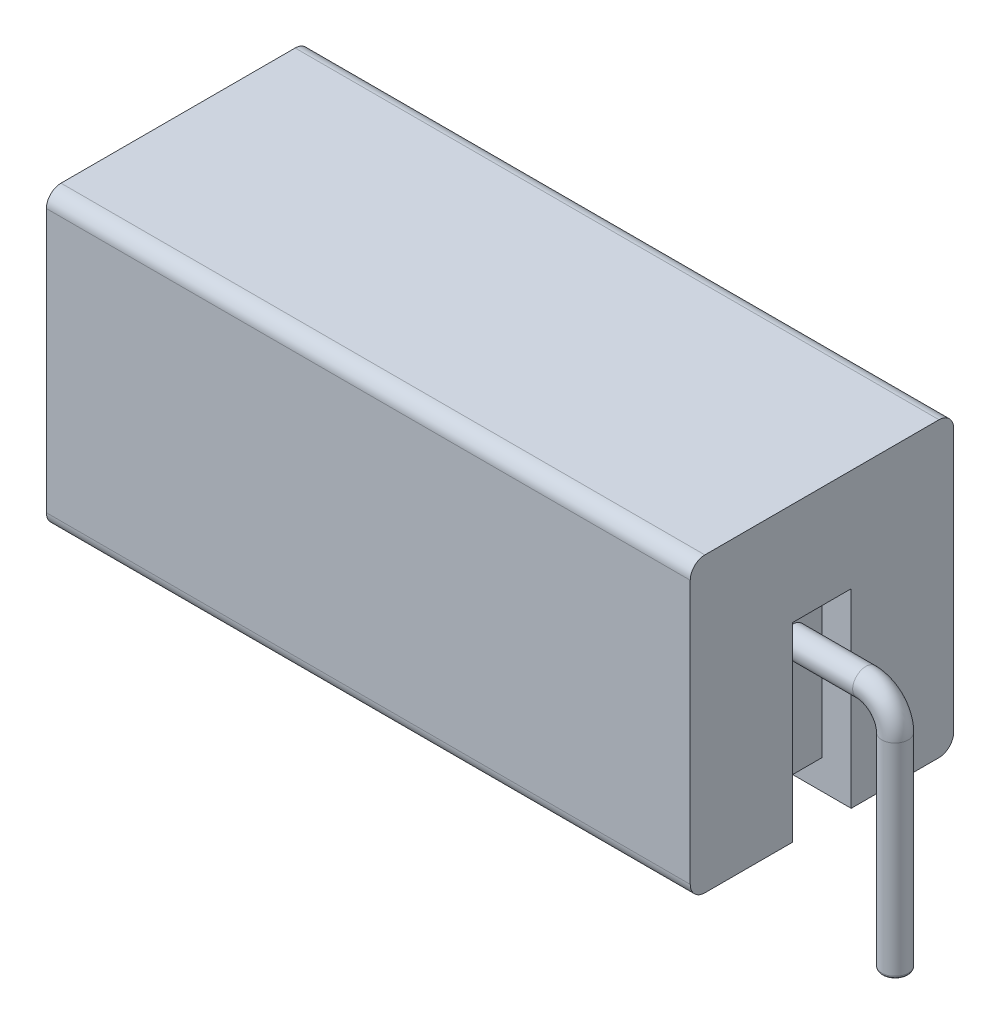
ISO-10303-21;
HEADER;
FILE_DESCRIPTION(('STEP AP214'),'2;1');
FILE_NAME('part.step','',(''),(''),'','','');
FILE_SCHEMA(('AUTOMOTIVE_DESIGN { 1 0 10303 214 1 1 1 1 }'));
ENDSEC;
DATA;
#1=APPLICATION_CONTEXT('core data for automotive mechanical design processes');
#2=APPLICATION_PROTOCOL_DEFINITION('international standard','automotive_design',2000,#1);
#3=PRODUCT_CONTEXT('',#1,'mechanical');
#4=PRODUCT('Part','Part','',(#3));
#5=PRODUCT_RELATED_PRODUCT_CATEGORY('part','',(#4));
#6=PRODUCT_DEFINITION_FORMATION('','',#4);
#7=PRODUCT_DEFINITION_CONTEXT('part definition',#1,'design');
#8=PRODUCT_DEFINITION('design','',#6,#7);
#9=PRODUCT_DEFINITION_SHAPE('','',#8);
#10=(LENGTH_UNIT() NAMED_UNIT(*) SI_UNIT(.MILLI.,.METRE.));
#11=(NAMED_UNIT(*) PLANE_ANGLE_UNIT() SI_UNIT($,.RADIAN.));
#12=(NAMED_UNIT(*) SI_UNIT($,.STERADIAN.) SOLID_ANGLE_UNIT());
#13=UNCERTAINTY_MEASURE_WITH_UNIT(LENGTH_MEASURE(1.E-05),#10,'distance_accuracy_value','');
#14=(GEOMETRIC_REPRESENTATION_CONTEXT(3) GLOBAL_UNCERTAINTY_ASSIGNED_CONTEXT((#13)) GLOBAL_UNIT_ASSIGNED_CONTEXT((#10,
#11,#12)) REPRESENTATION_CONTEXT('',''));
#15=CARTESIAN_POINT('',(0.,0.,0.));
#16=DIRECTION('',(0.,0.,1.));
#17=DIRECTION('',(1.,0.,0.));
#18=AXIS2_PLACEMENT_3D('',#15,#16,#17);
#19=CARTESIAN_POINT('',(0.,-10.,9.));
#20=DIRECTION('',(0.,1.,0.));
#21=DIRECTION('',(0.,0.,1.));
#22=AXIS2_PLACEMENT_3D('',#19,#20,#21);
#23=PLANE('',#22);
#24=DIRECTION('',(-1.,0.,0.));
#25=VECTOR('',#24,1.);
#26=CARTESIAN_POINT('',(1.,-10.,5.5));
#27=LINE('',#26,#25);
#28=CARTESIAN_POINT('',(3.,-10.,5.5));
#29=VERTEX_POINT('',#28);
#30=CARTESIAN_POINT('',(0.,-10.,5.5));
#31=VERTEX_POINT('',#30);
#32=EDGE_CURVE('E252',#29,#31,#27,.T.);
#33=ORIENTED_EDGE('',*,*,#32,.F.);
#34=DIRECTION('',(0.,0.,-1.));
#35=VECTOR('',#34,1.);
#36=CARTESIAN_POINT('',(3.,-10.,8.));
#37=LINE('',#36,#35);
#38=CARTESIAN_POINT('',(3.,-10.,8.));
#39=VERTEX_POINT('',#38);
#40=EDGE_CURVE('E380',#39,#29,#37,.T.);
#41=ORIENTED_EDGE('',*,*,#40,.F.);
#42=DIRECTION('',(-1.,0.,0.));
#43=VECTOR('',#42,1.);
#44=CARTESIAN_POINT('',(3.,-10.,8.));
#45=LINE('',#44,#43);
#46=CARTESIAN_POINT('',(19.,-10.,8.));
#47=VERTEX_POINT('',#46);
#48=EDGE_CURVE('E372',#47,#39,#45,.T.);
#49=ORIENTED_EDGE('',*,*,#48,.F.);
#50=DIRECTION('',(0.,0.,1.));
#51=VECTOR('',#50,1.);
#52=CARTESIAN_POINT('',(19.,-10.,8.));
#53=LINE('',#52,#51);
#54=CARTESIAN_POINT('',(19.,-10.,5.5));
#55=VERTEX_POINT('',#54);
#56=EDGE_CURVE('E368',#55,#47,#53,.T.);
#57=ORIENTED_EDGE('',*,*,#56,.F.);
#58=DIRECTION('',(-1.,0.,0.));
#59=VECTOR('',#58,1.);
#60=CARTESIAN_POINT('',(22.,-10.,5.5));
#61=LINE('',#60,#59);
#62=CARTESIAN_POINT('',(22.,-10.,5.5));
#63=VERTEX_POINT('',#62);
#64=EDGE_CURVE('E276',#63,#55,#61,.T.);
#65=ORIENTED_EDGE('',*,*,#64,.F.);
#66=DIRECTION('',(0.,0.,-1.));
#67=VECTOR('',#66,1.);
#68=CARTESIAN_POINT('',(22.,-10.,9.));
#69=LINE('',#68,#67);
#70=CARTESIAN_POINT('',(22.,-10.,8.5));
#71=VERTEX_POINT('',#70);
#72=EDGE_CURVE('E413',#71,#63,#69,.T.);
#73=ORIENTED_EDGE('',*,*,#72,.F.);
#74=DIRECTION('',(1.,0.,0.));
#75=VECTOR('',#74,1.);
#76=CARTESIAN_POINT('',(0.,-10.,8.5));
#77=LINE('',#76,#75);
#78=CARTESIAN_POINT('',(0.,-10.,8.5));
#79=VERTEX_POINT('',#78);
#80=EDGE_CURVE('E445',#71,#79,#77,.F.);
#81=ORIENTED_EDGE('',*,*,#80,.T.);
#82=DIRECTION('',(0.,0.,-1.));
#83=VECTOR('',#82,1.);
#84=CARTESIAN_POINT('',(0.,-10.,9.));
#85=LINE('',#84,#83);
#86=EDGE_CURVE('E412',#79,#31,#85,.T.);
#87=ORIENTED_EDGE('',*,*,#86,.T.);
#88=EDGE_LOOP('',(#33,#41,#49,#57,#65,#73,#81,#87));
#89=FACE_BOUND('',#88,.T.);
#90=ADVANCED_FACE('F70',(#89),#23,.F.);
#91=CARTESIAN_POINT('',(0.,0.,9.));
#92=DIRECTION('',(1.,0.,0.));
#93=DIRECTION('',(0.,1.,0.));
#94=AXIS2_PLACEMENT_3D('',#91,#92,#93);
#95=PLANE('',#94);
#96=CARTESIAN_POINT('',(0.,-10.,3.5));
#97=VERTEX_POINT('',#96);
#98=CARTESIAN_POINT('',(0.,-10.,0.5));
#99=VERTEX_POINT('',#98);
#100=EDGE_CURVE('E405',#97,#99,#85,.T.);
#101=ORIENTED_EDGE('',*,*,#100,.F.);
#102=DIRECTION('',(0.,-1.,0.));
#103=VECTOR('',#102,1.);
#104=CARTESIAN_POINT('',(0.,-3.5,3.5));
#105=LINE('',#104,#103);
#106=CARTESIAN_POINT('',(0.,-3.5,3.5));
#107=VERTEX_POINT('',#106);
#108=EDGE_CURVE('E267',#107,#97,#105,.T.);
#109=ORIENTED_EDGE('',*,*,#108,.F.);
#110=DIRECTION('',(0.,0.,-1.));
#111=VECTOR('',#110,1.);
#112=CARTESIAN_POINT('',(0.,-3.5,5.5));
#113=LINE('',#112,#111);
#114=CARTESIAN_POINT('',(0.,-3.5,5.5));
#115=VERTEX_POINT('',#114);
#116=EDGE_CURVE('E263',#115,#107,#113,.T.);
#117=ORIENTED_EDGE('',*,*,#116,.F.);
#118=DIRECTION('',(0.,1.,0.));
#119=VECTOR('',#118,1.);
#120=CARTESIAN_POINT('',(0.,-10.,5.5));
#121=LINE('',#120,#119);
#122=EDGE_CURVE('E260',#31,#115,#121,.T.);
#123=ORIENTED_EDGE('',*,*,#122,.F.);
#124=ORIENTED_EDGE('',*,*,#86,.F.);
#125=CARTESIAN_POINT('',(0.,-9.5,8.5));
#126=DIRECTION('',(1.,0.,0.));
#127=DIRECTION('',(0.,1.,0.));
#128=AXIS2_PLACEMENT_3D('',#125,#126,#127);
#129=CIRCLE('',#128,0.5);
#130=CARTESIAN_POINT('',(0.,-9.5,9.));
#131=VERTEX_POINT('',#130);
#132=EDGE_CURVE('E440',#79,#131,#129,.F.);
#133=ORIENTED_EDGE('',*,*,#132,.T.);
#134=DIRECTION('',(0.,-1.,0.));
#135=VECTOR('',#134,1.);
#136=CARTESIAN_POINT('',(0.,0.,9.));
#137=LINE('',#136,#135);
#138=CARTESIAN_POINT('',(0.,-0.5,9.));
#139=VERTEX_POINT('',#138);
#140=EDGE_CURVE('E461',#139,#131,#137,.T.);
#141=ORIENTED_EDGE('',*,*,#140,.F.);
#142=CARTESIAN_POINT('',(0.,-0.5,8.5));
#143=DIRECTION('',(1.,0.,0.));
#144=DIRECTION('',(0.,1.,0.));
#145=AXIS2_PLACEMENT_3D('',#142,#143,#144);
#146=CIRCLE('',#145,0.5);
#147=CARTESIAN_POINT('',(0.,0.,8.5));
#148=VERTEX_POINT('',#147);
#149=EDGE_CURVE('E438',#139,#148,#146,.F.);
#150=ORIENTED_EDGE('',*,*,#149,.T.);
#151=DIRECTION('',(0.,0.,-1.));
#152=VECTOR('',#151,1.);
#153=CARTESIAN_POINT('',(0.,0.,9.));
#154=LINE('',#153,#152);
#155=CARTESIAN_POINT('',(0.,0.,0.5));
#156=VERTEX_POINT('',#155);
#157=EDGE_CURVE('E466',#148,#156,#154,.T.);
#158=ORIENTED_EDGE('',*,*,#157,.T.);
#159=CARTESIAN_POINT('',(0.,-0.5,0.5));
#160=DIRECTION('',(1.,0.,0.));
#161=DIRECTION('',(0.,1.,0.));
#162=AXIS2_PLACEMENT_3D('',#159,#160,#161);
#163=CIRCLE('',#162,0.5);
#164=CARTESIAN_POINT('',(0.,-0.5,0.));
#165=VERTEX_POINT('',#164);
#166=EDGE_CURVE('E443',#156,#165,#163,.F.);
#167=ORIENTED_EDGE('',*,*,#166,.T.);
#168=DIRECTION('',(0.,-1.,0.));
#169=VECTOR('',#168,1.);
#170=CARTESIAN_POINT('',(0.,0.,0.));
#171=LINE('',#170,#169);
#172=CARTESIAN_POINT('',(0.,-9.5,0.));
#173=VERTEX_POINT('',#172);
#174=EDGE_CURVE('E287',#165,#173,#171,.T.);
#175=ORIENTED_EDGE('',*,*,#174,.T.);
#176=CARTESIAN_POINT('',(0.,-9.5,0.5));
#177=DIRECTION('',(1.,0.,0.));
#178=DIRECTION('',(0.,1.,0.));
#179=AXIS2_PLACEMENT_3D('',#176,#177,#178);
#180=CIRCLE('',#179,0.5);
#181=EDGE_CURVE('E410',#173,#99,#180,.F.);
#182=ORIENTED_EDGE('',*,*,#181,.T.);
#183=EDGE_LOOP('',(#101,#109,#117,#123,#124,#133,#141,#150,#158,#167,#175,#182));
#184=FACE_BOUND('',#183,.T.);
#185=ADVANCED_FACE('F331',(#184),#95,.F.);
#186=DIRECTION('',(-1.,0.,0.));
#187=VECTOR('',#186,1.);
#188=CARTESIAN_POINT('',(22.,-10.,3.5));
#189=LINE('',#188,#187);
#190=CARTESIAN_POINT('',(22.,-10.,3.5));
#191=VERTEX_POINT('',#190);
#192=CARTESIAN_POINT('',(19.,-10.,3.5));
#193=VERTEX_POINT('',#192);
#194=EDGE_CURVE('E93',#191,#193,#189,.T.);
#195=ORIENTED_EDGE('',*,*,#194,.T.);
#196=DIRECTION('',(0.,0.,1.));
#197=VECTOR('',#196,1.);
#198=CARTESIAN_POINT('',(19.,-10.,0.999999999999997));
#199=LINE('',#198,#197);
#200=CARTESIAN_POINT('',(19.,-10.,0.999999999999997));
#201=VERTEX_POINT('',#200);
#202=EDGE_CURVE('E353',#201,#193,#199,.T.);
#203=ORIENTED_EDGE('',*,*,#202,.F.);
#204=DIRECTION('',(1.,0.,0.));
#205=VECTOR('',#204,1.);
#206=CARTESIAN_POINT('',(19.,-10.,0.999999999999997));
#207=LINE('',#206,#205);
#208=CARTESIAN_POINT('',(3.,-10.,0.999999999999995));
#209=VERTEX_POINT('',#208);
#210=EDGE_CURVE('E369',#209,#201,#207,.T.);
#211=ORIENTED_EDGE('',*,*,#210,.F.);
#212=DIRECTION('',(0.,0.,-1.));
#213=VECTOR('',#212,1.);
#214=CARTESIAN_POINT('',(3.,-10.,0.999999999999995));
#215=LINE('',#214,#213);
#216=CARTESIAN_POINT('',(3.,-10.,3.5));
#217=VERTEX_POINT('',#216);
#218=EDGE_CURVE('E374',#217,#209,#215,.T.);
#219=ORIENTED_EDGE('',*,*,#218,.F.);
#220=DIRECTION('',(-1.,0.,0.));
#221=VECTOR('',#220,1.);
#222=CARTESIAN_POINT('',(1.,-10.,3.5));
#223=LINE('',#222,#221);
#224=EDGE_CURVE('E269',#217,#97,#223,.T.);
#225=ORIENTED_EDGE('',*,*,#224,.T.);
#226=ORIENTED_EDGE('',*,*,#100,.T.);
#227=DIRECTION('',(1.,0.,0.));
#228=VECTOR('',#227,1.);
#229=CARTESIAN_POINT('',(0.,-10.,0.5));
#230=LINE('',#229,#228);
#231=CARTESIAN_POINT('',(22.,-10.,0.5));
#232=VERTEX_POINT('',#231);
#233=EDGE_CURVE('E447',#99,#232,#230,.T.);
#234=ORIENTED_EDGE('',*,*,#233,.T.);
#235=EDGE_CURVE('E301',#191,#232,#69,.T.);
#236=ORIENTED_EDGE('',*,*,#235,.F.);
#237=EDGE_LOOP('',(#195,#203,#211,#219,#225,#226,#234,#236));
#238=FACE_BOUND('',#237,.T.);
#239=ADVANCED_FACE('F334',(#238),#23,.F.);
#240=CARTESIAN_POINT('',(22.,0.,9.));
#241=DIRECTION('',(1.,0.,0.));
#242=DIRECTION('',(0.,0.,-1.));
#243=AXIS2_PLACEMENT_3D('',#240,#241,#242);
#244=PLANE('',#243);
#245=DIRECTION('',(0.,1.,0.));
#246=VECTOR('',#245,1.);
#247=CARTESIAN_POINT('',(22.,-10.,5.5));
#248=LINE('',#247,#246);
#249=CARTESIAN_POINT('',(22.,-3.5,5.5));
#250=VERTEX_POINT('',#249);
#251=EDGE_CURVE('E278',#63,#250,#248,.T.);
#252=ORIENTED_EDGE('',*,*,#251,.T.);
#253=DIRECTION('',(0.,0.,-1.));
#254=VECTOR('',#253,1.);
#255=CARTESIAN_POINT('',(22.,-3.5,5.5));
#256=LINE('',#255,#254);
#257=CARTESIAN_POINT('',(22.,-3.5,3.5));
#258=VERTEX_POINT('',#257);
#259=EDGE_CURVE('E503',#250,#258,#256,.T.);
#260=ORIENTED_EDGE('',*,*,#259,.T.);
#261=DIRECTION('',(0.,-1.,0.));
#262=VECTOR('',#261,1.);
#263=CARTESIAN_POINT('',(22.,-3.5,3.5));
#264=LINE('',#263,#262);
#265=EDGE_CURVE('E288',#258,#191,#264,.T.);
#266=ORIENTED_EDGE('',*,*,#265,.T.);
#267=ORIENTED_EDGE('',*,*,#235,.T.);
#268=CARTESIAN_POINT('',(22.,-9.5,0.5));
#269=DIRECTION('',(1.,0.,0.));
#270=DIRECTION('',(0.,0.,-1.));
#271=AXIS2_PLACEMENT_3D('',#268,#269,#270);
#272=CIRCLE('',#271,0.5);
#273=CARTESIAN_POINT('',(22.,-9.5,0.));
#274=VERTEX_POINT('',#273);
#275=EDGE_CURVE('E429',#232,#274,#272,.T.);
#276=ORIENTED_EDGE('',*,*,#275,.T.);
#277=DIRECTION('',(0.,-1.,0.));
#278=VECTOR('',#277,1.);
#279=CARTESIAN_POINT('',(22.,0.,0.));
#280=LINE('',#279,#278);
#281=CARTESIAN_POINT('',(22.,-0.5,0.));
#282=VERTEX_POINT('',#281);
#283=EDGE_CURVE('E471',#282,#274,#280,.T.);
#284=ORIENTED_EDGE('',*,*,#283,.F.);
#285=CARTESIAN_POINT('',(22.,-0.5,0.5));
#286=DIRECTION('',(1.,0.,0.));
#287=DIRECTION('',(0.,0.,-1.));
#288=AXIS2_PLACEMENT_3D('',#285,#286,#287);
#289=CIRCLE('',#288,0.5);
#290=CARTESIAN_POINT('',(22.,0.,0.5));
#291=VERTEX_POINT('',#290);
#292=EDGE_CURVE('E431',#282,#291,#289,.T.);
#293=ORIENTED_EDGE('',*,*,#292,.T.);
#294=DIRECTION('',(0.,0.,-1.));
#295=VECTOR('',#294,1.);
#296=CARTESIAN_POINT('',(22.,0.,9.));
#297=LINE('',#296,#295);
#298=CARTESIAN_POINT('',(22.,0.,8.5));
#299=VERTEX_POINT('',#298);
#300=EDGE_CURVE('E469',#299,#291,#297,.T.);
#301=ORIENTED_EDGE('',*,*,#300,.F.);
#302=CARTESIAN_POINT('',(22.,-0.5,8.5));
#303=DIRECTION('',(1.,0.,0.));
#304=DIRECTION('',(0.,0.,-1.));
#305=AXIS2_PLACEMENT_3D('',#302,#303,#304);
#306=CIRCLE('',#305,0.5);
#307=CARTESIAN_POINT('',(22.,-0.5,9.));
#308=VERTEX_POINT('',#307);
#309=EDGE_CURVE('E425',#299,#308,#306,.T.);
#310=ORIENTED_EDGE('',*,*,#309,.T.);
#311=DIRECTION('',(0.,-1.,0.));
#312=VECTOR('',#311,1.);
#313=CARTESIAN_POINT('',(22.,0.,9.));
#314=LINE('',#313,#312);
#315=CARTESIAN_POINT('',(22.,-9.5,9.));
#316=VERTEX_POINT('',#315);
#317=EDGE_CURVE('E458',#308,#316,#314,.T.);
#318=ORIENTED_EDGE('',*,*,#317,.T.);
#319=CARTESIAN_POINT('',(22.,-9.5,8.5));
#320=DIRECTION('',(1.,0.,0.));
#321=DIRECTION('',(0.,0.,-1.));
#322=AXIS2_PLACEMENT_3D('',#319,#320,#321);
#323=CIRCLE('',#322,0.5);
#324=EDGE_CURVE('E427',#316,#71,#323,.T.);
#325=ORIENTED_EDGE('',*,*,#324,.T.);
#326=ORIENTED_EDGE('',*,*,#72,.T.);
#327=EDGE_LOOP('',(#252,#260,#266,#267,#276,#284,#293,#301,#310,#318,#325,#326));
#328=FACE_BOUND('',#327,.T.);
#329=ADVANCED_FACE('F342',(#328),#244,.T.);
#330=CARTESIAN_POINT('',(0.,0.,9.));
#331=DIRECTION('',(0.,1.,0.));
#332=DIRECTION('',(0.,0.,1.));
#333=AXIS2_PLACEMENT_3D('',#330,#331,#332);
#334=PLANE('',#333);
#335=ORIENTED_EDGE('',*,*,#300,.T.);
#336=DIRECTION('',(1.,0.,0.));
#337=VECTOR('',#336,1.);
#338=CARTESIAN_POINT('',(0.,0.,0.5));
#339=LINE('',#338,#337);
#340=EDGE_CURVE('E436',#291,#156,#339,.F.);
#341=ORIENTED_EDGE('',*,*,#340,.T.);
#342=ORIENTED_EDGE('',*,*,#157,.F.);
#343=DIRECTION('',(1.,0.,0.));
#344=VECTOR('',#343,1.);
#345=CARTESIAN_POINT('',(0.,0.,8.5));
#346=LINE('',#345,#344);
#347=EDGE_CURVE('E433',#148,#299,#346,.T.);
#348=ORIENTED_EDGE('',*,*,#347,.T.);
#349=EDGE_LOOP('',(#335,#341,#342,#348));
#350=FACE_BOUND('',#349,.T.);
#351=ADVANCED_FACE('F347',(#350),#334,.T.);
#352=CARTESIAN_POINT('',(0.,0.,9.));
#353=DIRECTION('',(0.,0.,1.));
#354=DIRECTION('',(1.,0.,0.));
#355=AXIS2_PLACEMENT_3D('',#352,#353,#354);
#356=PLANE('',#355);
#357=ORIENTED_EDGE('',*,*,#140,.T.);
#358=DIRECTION('',(1.,0.,0.));
#359=VECTOR('',#358,1.);
#360=CARTESIAN_POINT('',(22.,-9.5,9.));
#361=LINE('',#360,#359);
#362=EDGE_CURVE('E308',#131,#316,#361,.T.);
#363=ORIENTED_EDGE('',*,*,#362,.T.);
#364=ORIENTED_EDGE('',*,*,#317,.F.);
#365=DIRECTION('',(1.,0.,0.));
#366=VECTOR('',#365,1.);
#367=CARTESIAN_POINT('',(0.,-0.5,9.));
#368=LINE('',#367,#366);
#369=EDGE_CURVE('E449',#308,#139,#368,.F.);
#370=ORIENTED_EDGE('',*,*,#369,.T.);
#371=EDGE_LOOP('',(#357,#363,#364,#370));
#372=FACE_BOUND('',#371,.T.);
#373=ADVANCED_FACE('F457',(#372),#356,.T.);
#374=CARTESIAN_POINT('',(0.,0.,0.));
#375=DIRECTION('',(0.,0.,1.));
#376=DIRECTION('',(1.,0.,0.));
#377=AXIS2_PLACEMENT_3D('',#374,#375,#376);
#378=PLANE('',#377);
#379=ORIENTED_EDGE('',*,*,#174,.F.);
#380=DIRECTION('',(1.,0.,0.));
#381=VECTOR('',#380,1.);
#382=CARTESIAN_POINT('',(22.,-0.5,0.));
#383=LINE('',#382,#381);
#384=EDGE_CURVE('E422',#165,#282,#383,.T.);
#385=ORIENTED_EDGE('',*,*,#384,.T.);
#386=ORIENTED_EDGE('',*,*,#283,.T.);
#387=DIRECTION('',(1.,0.,0.));
#388=VECTOR('',#387,1.);
#389=CARTESIAN_POINT('',(0.,-9.5,0.));
#390=LINE('',#389,#388);
#391=EDGE_CURVE('E416',#274,#173,#390,.F.);
#392=ORIENTED_EDGE('',*,*,#391,.T.);
#393=EDGE_LOOP('',(#379,#385,#386,#392));
#394=FACE_BOUND('',#393,.T.);
#395=ADVANCED_FACE('F488',(#394),#378,.F.);
#396=CARTESIAN_POINT('',(0.,-0.5,0.5));
#397=DIRECTION('',(-1.,0.,0.));
#398=DIRECTION('',(0.,0.,1.));
#399=AXIS2_PLACEMENT_3D('',#396,#397,#398);
#400=CYLINDRICAL_SURFACE('',#399,0.5);
#401=ORIENTED_EDGE('',*,*,#166,.F.);
#402=ORIENTED_EDGE('',*,*,#340,.F.);
#403=ORIENTED_EDGE('',*,*,#292,.F.);
#404=ORIENTED_EDGE('',*,*,#384,.F.);
#405=EDGE_LOOP('',(#401,#402,#403,#404));
#406=FACE_BOUND('',#405,.T.);
#407=ADVANCED_FACE('F493',(#406),#400,.T.);
#408=CARTESIAN_POINT('',(0.,-9.5,0.5));
#409=DIRECTION('',(1.,0.,0.));
#410=DIRECTION('',(0.,0.,-1.));
#411=AXIS2_PLACEMENT_3D('',#408,#409,#410);
#412=CYLINDRICAL_SURFACE('',#411,0.5);
#413=ORIENTED_EDGE('',*,*,#181,.F.);
#414=ORIENTED_EDGE('',*,*,#391,.F.);
#415=ORIENTED_EDGE('',*,*,#275,.F.);
#416=ORIENTED_EDGE('',*,*,#233,.F.);
#417=EDGE_LOOP('',(#413,#414,#415,#416));
#418=FACE_BOUND('',#417,.T.);
#419=ADVANCED_FACE('F485',(#418),#412,.T.);
#420=CARTESIAN_POINT('',(0.,-9.5,8.5));
#421=DIRECTION('',(-1.,0.,0.));
#422=DIRECTION('',(0.,0.,1.));
#423=AXIS2_PLACEMENT_3D('',#420,#421,#422);
#424=CYLINDRICAL_SURFACE('',#423,0.5);
#425=ORIENTED_EDGE('',*,*,#132,.F.);
#426=ORIENTED_EDGE('',*,*,#80,.F.);
#427=ORIENTED_EDGE('',*,*,#324,.F.);
#428=ORIENTED_EDGE('',*,*,#362,.F.);
#429=EDGE_LOOP('',(#425,#426,#427,#428));
#430=FACE_BOUND('',#429,.T.);
#431=ADVANCED_FACE('F500',(#430),#424,.T.);
#432=CARTESIAN_POINT('',(0.,-0.5,8.5));
#433=DIRECTION('',(1.,0.,0.));
#434=DIRECTION('',(0.,0.,-1.));
#435=AXIS2_PLACEMENT_3D('',#432,#433,#434);
#436=CYLINDRICAL_SURFACE('',#435,0.5);
#437=ORIENTED_EDGE('',*,*,#149,.F.);
#438=ORIENTED_EDGE('',*,*,#369,.F.);
#439=ORIENTED_EDGE('',*,*,#309,.F.);
#440=ORIENTED_EDGE('',*,*,#347,.F.);
#441=EDGE_LOOP('',(#437,#438,#439,#440));
#442=FACE_BOUND('',#441,.T.);
#443=ADVANCED_FACE('F497',(#442),#436,.T.);
#444=CARTESIAN_POINT('',(21.,0.,0.));
#445=DIRECTION('',(1.,0.,0.));
#446=DIRECTION('',(0.,0.,-1.));
#447=AXIS2_PLACEMENT_3D('',#444,#445,#446);
#448=PLANE('',#447);
#449=CARTESIAN_POINT('',(21.,-5.,4.5));
#450=DIRECTION('',(1.,0.,0.));
#451=DIRECTION('',(0.,0.,-1.));
#452=AXIS2_PLACEMENT_3D('',#449,#450,#451);
#453=CIRCLE('',#452,0.45);
#454=CARTESIAN_POINT('',(21.,-5.,4.05));
#455=VERTEX_POINT('',#454);
#456=EDGE_CURVE('E304',#455,#455,#453,.T.);
#457=ORIENTED_EDGE('',*,*,#456,.F.);
#458=EDGE_LOOP('',(#457));
#459=FACE_BOUND('',#458,.T.);
#460=DIRECTION('',(0.,0.,1.));
#461=VECTOR('',#460,1.);
#462=CARTESIAN_POINT('',(21.,-9.,5.5));
#463=LINE('',#462,#461);
#464=CARTESIAN_POINT('',(21.,-9.,3.5));
#465=VERTEX_POINT('',#464);
#466=CARTESIAN_POINT('',(21.,-9.,5.5));
#467=VERTEX_POINT('',#466);
#468=EDGE_CURVE('E532',#465,#467,#463,.T.);
#469=ORIENTED_EDGE('',*,*,#468,.F.);
#470=DIRECTION('',(0.,-1.,0.));
#471=VECTOR('',#470,1.);
#472=CARTESIAN_POINT('',(21.,-3.5,3.5));
#473=LINE('',#472,#471);
#474=CARTESIAN_POINT('',(21.,-3.5,3.5));
#475=VERTEX_POINT('',#474);
#476=EDGE_CURVE('E292',#475,#465,#473,.T.);
#477=ORIENTED_EDGE('',*,*,#476,.F.);
#478=DIRECTION('',(0.,0.,-1.));
#479=VECTOR('',#478,1.);
#480=CARTESIAN_POINT('',(21.,-3.5,5.5));
#481=LINE('',#480,#479);
#482=CARTESIAN_POINT('',(21.,-3.5,5.5));
#483=VERTEX_POINT('',#482);
#484=EDGE_CURVE('E511',#483,#475,#481,.T.);
#485=ORIENTED_EDGE('',*,*,#484,.F.);
#486=DIRECTION('',(0.,1.,0.));
#487=VECTOR('',#486,1.);
#488=CARTESIAN_POINT('',(21.,-10.,5.5));
#489=LINE('',#488,#487);
#490=EDGE_CURVE('E272',#467,#483,#489,.T.);
#491=ORIENTED_EDGE('',*,*,#490,.F.);
#492=EDGE_LOOP('',(#469,#477,#485,#491));
#493=FACE_BOUND('',#492,.T.);
#494=ADVANCED_FACE('F530',(#459,#493),#448,.T.);
#495=CARTESIAN_POINT('',(22.,-10.,5.5));
#496=DIRECTION('',(0.,0.,1.));
#497=DIRECTION('',(1.,0.,0.));
#498=AXIS2_PLACEMENT_3D('',#495,#496,#497);
#499=PLANE('',#498);
#500=ORIENTED_EDGE('',*,*,#64,.T.);
#501=DIRECTION('',(0.,-1.,0.));
#502=VECTOR('',#501,1.);
#503=CARTESIAN_POINT('',(19.,-9.,5.5));
#504=LINE('',#503,#502);
#505=CARTESIAN_POINT('',(19.,-9.,5.5));
#506=VERTEX_POINT('',#505);
#507=EDGE_CURVE('E363',#506,#55,#504,.T.);
#508=ORIENTED_EDGE('',*,*,#507,.F.);
#509=DIRECTION('',(-1.,0.,0.));
#510=VECTOR('',#509,1.);
#511=CARTESIAN_POINT('',(19.,-9.,5.5));
#512=LINE('',#511,#510);
#513=EDGE_CURVE('E534',#467,#506,#512,.T.);
#514=ORIENTED_EDGE('',*,*,#513,.F.);
#515=ORIENTED_EDGE('',*,*,#490,.T.);
#516=DIRECTION('',(-1.,0.,0.));
#517=VECTOR('',#516,1.);
#518=CARTESIAN_POINT('',(22.,-3.5,5.5));
#519=LINE('',#518,#517);
#520=EDGE_CURVE('E283',#250,#483,#519,.T.);
#521=ORIENTED_EDGE('',*,*,#520,.F.);
#522=ORIENTED_EDGE('',*,*,#251,.F.);
#523=EDGE_LOOP('',(#500,#508,#514,#515,#521,#522));
#524=FACE_BOUND('',#523,.T.);
#525=ADVANCED_FACE('F506',(#524),#499,.F.);
#526=CARTESIAN_POINT('',(22.,-3.5,5.5));
#527=DIRECTION('',(0.,1.,0.));
#528=DIRECTION('',(0.,0.,1.));
#529=AXIS2_PLACEMENT_3D('',#526,#527,#528);
#530=PLANE('',#529);
#531=ORIENTED_EDGE('',*,*,#484,.T.);
#532=DIRECTION('',(-1.,0.,0.));
#533=VECTOR('',#532,1.);
#534=CARTESIAN_POINT('',(22.,-3.5,3.5));
#535=LINE('',#534,#533);
#536=EDGE_CURVE('E521',#258,#475,#535,.T.);
#537=ORIENTED_EDGE('',*,*,#536,.F.);
#538=ORIENTED_EDGE('',*,*,#259,.F.);
#539=ORIENTED_EDGE('',*,*,#520,.T.);
#540=EDGE_LOOP('',(#531,#537,#538,#539));
#541=FACE_BOUND('',#540,.T.);
#542=ADVANCED_FACE('F591',(#541),#530,.F.);
#543=CARTESIAN_POINT('',(22.,-3.5,3.5));
#544=DIRECTION('',(0.,0.,-1.));
#545=DIRECTION('',(0.,1.,0.));
#546=AXIS2_PLACEMENT_3D('',#543,#544,#545);
#547=PLANE('',#546);
#548=ORIENTED_EDGE('',*,*,#476,.T.);
#549=DIRECTION('',(1.,0.,0.));
#550=VECTOR('',#549,1.);
#551=CARTESIAN_POINT('',(21.,-9.,3.5));
#552=LINE('',#551,#550);
#553=CARTESIAN_POINT('',(19.,-9.,3.5));
#554=VERTEX_POINT('',#553);
#555=EDGE_CURVE('E359',#554,#465,#552,.T.);
#556=ORIENTED_EDGE('',*,*,#555,.F.);
#557=DIRECTION('',(0.,-1.,0.));
#558=VECTOR('',#557,1.);
#559=CARTESIAN_POINT('',(19.,-9.,3.5));
#560=LINE('',#559,#558);
#561=EDGE_CURVE('E356',#554,#193,#560,.T.);
#562=ORIENTED_EDGE('',*,*,#561,.T.);
#563=ORIENTED_EDGE('',*,*,#194,.F.);
#564=ORIENTED_EDGE('',*,*,#265,.F.);
#565=ORIENTED_EDGE('',*,*,#536,.T.);
#566=EDGE_LOOP('',(#548,#556,#562,#563,#564,#565));
#567=FACE_BOUND('',#566,.T.);
#568=ADVANCED_FACE('F358',(#567),#547,.F.);
#569=CARTESIAN_POINT('',(1.,-3.5,3.5));
#570=DIRECTION('',(0.,0.,-1.));
#571=DIRECTION('',(0.,1.,0.));
#572=AXIS2_PLACEMENT_3D('',#569,#570,#571);
#573=PLANE('',#572);
#574=ORIENTED_EDGE('',*,*,#108,.T.);
#575=ORIENTED_EDGE('',*,*,#224,.F.);
#576=DIRECTION('',(0.,-1.,0.));
#577=VECTOR('',#576,1.);
#578=CARTESIAN_POINT('',(3.,-9.,3.5));
#579=LINE('',#578,#577);
#580=CARTESIAN_POINT('',(3.,-9.,3.5));
#581=VERTEX_POINT('',#580);
#582=EDGE_CURVE('E238',#581,#217,#579,.T.);
#583=ORIENTED_EDGE('',*,*,#582,.F.);
#584=DIRECTION('',(1.,0.,0.));
#585=VECTOR('',#584,1.);
#586=CARTESIAN_POINT('',(1.,-9.,3.5));
#587=LINE('',#586,#585);
#588=CARTESIAN_POINT('',(1.,-9.,3.5));
#589=VERTEX_POINT('',#588);
#590=EDGE_CURVE('E233',#589,#581,#587,.T.);
#591=ORIENTED_EDGE('',*,*,#590,.F.);
#592=DIRECTION('',(0.,-1.,0.));
#593=VECTOR('',#592,1.);
#594=CARTESIAN_POINT('',(1.,-3.5,3.5));
#595=LINE('',#594,#593);
#596=CARTESIAN_POINT('',(1.,-3.5,3.5));
#597=VERTEX_POINT('',#596);
#598=EDGE_CURVE('E236',#597,#589,#595,.T.);
#599=ORIENTED_EDGE('',*,*,#598,.F.);
#600=DIRECTION('',(-1.,0.,0.));
#601=VECTOR('',#600,1.);
#602=CARTESIAN_POINT('',(1.,-3.5,3.5));
#603=LINE('',#602,#601);
#604=EDGE_CURVE('E273',#597,#107,#603,.T.);
#605=ORIENTED_EDGE('',*,*,#604,.T.);
#606=EDGE_LOOP('',(#574,#575,#583,#591,#599,#605));
#607=FACE_BOUND('',#606,.T.);
#608=ADVANCED_FACE('F234',(#607),#573,.F.);
#609=CARTESIAN_POINT('',(1.,-3.5,5.5));
#610=DIRECTION('',(0.,1.,0.));
#611=DIRECTION('',(-1.,0.,0.));
#612=AXIS2_PLACEMENT_3D('',#609,#610,#611);
#613=PLANE('',#612);
#614=ORIENTED_EDGE('',*,*,#116,.T.);
#615=ORIENTED_EDGE('',*,*,#604,.F.);
#616=DIRECTION('',(0.,0.,-1.));
#617=VECTOR('',#616,1.);
#618=CARTESIAN_POINT('',(1.,-3.5,5.5));
#619=LINE('',#618,#617);
#620=CARTESIAN_POINT('',(1.,-3.5,5.5));
#621=VERTEX_POINT('',#620);
#622=EDGE_CURVE('E251',#621,#597,#619,.T.);
#623=ORIENTED_EDGE('',*,*,#622,.F.);
#624=DIRECTION('',(-1.,0.,0.));
#625=VECTOR('',#624,1.);
#626=CARTESIAN_POINT('',(1.,-3.5,5.5));
#627=LINE('',#626,#625);
#628=EDGE_CURVE('E254',#621,#115,#627,.T.);
#629=ORIENTED_EDGE('',*,*,#628,.T.);
#630=EDGE_LOOP('',(#614,#615,#623,#629));
#631=FACE_BOUND('',#630,.T.);
#632=ADVANCED_FACE('F401',(#631),#613,.F.);
#633=CARTESIAN_POINT('',(1.,-10.,5.5));
#634=DIRECTION('',(0.,0.,1.));
#635=DIRECTION('',(1.,0.,0.));
#636=AXIS2_PLACEMENT_3D('',#633,#634,#635);
#637=PLANE('',#636);
#638=ORIENTED_EDGE('',*,*,#122,.T.);
#639=ORIENTED_EDGE('',*,*,#628,.F.);
#640=DIRECTION('',(0.,1.,0.));
#641=VECTOR('',#640,1.);
#642=CARTESIAN_POINT('',(1.,-10.,5.5));
#643=LINE('',#642,#641);
#644=CARTESIAN_POINT('',(1.,-9.,5.5));
#645=VERTEX_POINT('',#644);
#646=EDGE_CURVE('E256',#645,#621,#643,.T.);
#647=ORIENTED_EDGE('',*,*,#646,.F.);
#648=DIRECTION('',(-1.,0.,0.));
#649=VECTOR('',#648,1.);
#650=CARTESIAN_POINT('',(1.,-9.,5.5));
#651=LINE('',#650,#649);
#652=CARTESIAN_POINT('',(3.,-9.,5.5));
#653=VERTEX_POINT('',#652);
#654=EDGE_CURVE('E85',#653,#645,#651,.T.);
#655=ORIENTED_EDGE('',*,*,#654,.F.);
#656=DIRECTION('',(0.,-1.,0.));
#657=VECTOR('',#656,1.);
#658=CARTESIAN_POINT('',(3.,-9.,5.5));
#659=LINE('',#658,#657);
#660=EDGE_CURVE('E264',#653,#29,#659,.T.);
#661=ORIENTED_EDGE('',*,*,#660,.T.);
#662=ORIENTED_EDGE('',*,*,#32,.T.);
#663=EDGE_LOOP('',(#638,#639,#647,#655,#661,#662));
#664=FACE_BOUND('',#663,.T.);
#665=ADVANCED_FACE('F397',(#664),#637,.F.);
#666=CARTESIAN_POINT('',(1.,0.,0.));
#667=DIRECTION('',(-1.,0.,0.));
#668=DIRECTION('',(0.,-1.,0.));
#669=AXIS2_PLACEMENT_3D('',#666,#667,#668);
#670=PLANE('',#669);
#671=CARTESIAN_POINT('',(1.,-5.,4.5));
#672=DIRECTION('',(-1.,0.,0.));
#673=DIRECTION('',(0.,-1.,0.));
#674=AXIS2_PLACEMENT_3D('',#671,#672,#673);
#675=CIRCLE('',#674,0.45);
#676=CARTESIAN_POINT('',(1.,-5.45,4.5));
#677=VERTEX_POINT('',#676);
#678=EDGE_CURVE('E307',#677,#677,#675,.T.);
#679=ORIENTED_EDGE('',*,*,#678,.F.);
#680=EDGE_LOOP('',(#679));
#681=FACE_BOUND('',#680,.T.);
#682=DIRECTION('',(0.,0.,-1.));
#683=VECTOR('',#682,1.);
#684=CARTESIAN_POINT('',(1.,-9.,5.5));
#685=LINE('',#684,#683);
#686=EDGE_CURVE('E242',#645,#589,#685,.T.);
#687=ORIENTED_EDGE('',*,*,#686,.F.);
#688=ORIENTED_EDGE('',*,*,#646,.T.);
#689=ORIENTED_EDGE('',*,*,#622,.T.);
#690=ORIENTED_EDGE('',*,*,#598,.T.);
#691=EDGE_LOOP('',(#687,#688,#689,#690));
#692=FACE_BOUND('',#691,.T.);
#693=ADVANCED_FACE('F249',(#681,#692),#670,.T.);
#694=CARTESIAN_POINT('',(3.,-9.,8.));
#695=DIRECTION('',(-1.,0.,0.));
#696=DIRECTION('',(0.,0.,1.));
#697=AXIS2_PLACEMENT_3D('',#694,#695,#696);
#698=PLANE('',#697);
#699=ORIENTED_EDGE('',*,*,#40,.T.);
#700=ORIENTED_EDGE('',*,*,#660,.F.);
#701=DIRECTION('',(0.,0.,-1.));
#702=VECTOR('',#701,1.);
#703=CARTESIAN_POINT('',(3.,-9.,8.));
#704=LINE('',#703,#702);
#705=CARTESIAN_POINT('',(3.,-9.,8.));
#706=VERTEX_POINT('',#705);
#707=EDGE_CURVE('E394',#706,#653,#704,.T.);
#708=ORIENTED_EDGE('',*,*,#707,.F.);
#709=DIRECTION('',(0.,-1.,0.));
#710=VECTOR('',#709,1.);
#711=CARTESIAN_POINT('',(3.,-9.,8.));
#712=LINE('',#711,#710);
#713=EDGE_CURVE('E385',#706,#39,#712,.T.);
#714=ORIENTED_EDGE('',*,*,#713,.T.);
#715=EDGE_LOOP('',(#699,#700,#708,#714));
#716=FACE_BOUND('',#715,.T.);
#717=ADVANCED_FACE('F581',(#716),#698,.F.);
#718=CARTESIAN_POINT('',(3.,-9.,8.));
#719=DIRECTION('',(0.,0.,1.));
#720=DIRECTION('',(1.,0.,0.));
#721=AXIS2_PLACEMENT_3D('',#718,#719,#720);
#722=PLANE('',#721);
#723=ORIENTED_EDGE('',*,*,#48,.T.);
#724=ORIENTED_EDGE('',*,*,#713,.F.);
#725=DIRECTION('',(-1.,0.,0.));
#726=VECTOR('',#725,1.);
#727=CARTESIAN_POINT('',(3.,-9.,8.));
#728=LINE('',#727,#726);
#729=CARTESIAN_POINT('',(19.,-9.,8.));
#730=VERTEX_POINT('',#729);
#731=EDGE_CURVE('E544',#730,#706,#728,.T.);
#732=ORIENTED_EDGE('',*,*,#731,.F.);
#733=DIRECTION('',(0.,-1.,0.));
#734=VECTOR('',#733,1.);
#735=CARTESIAN_POINT('',(19.,-9.,8.));
#736=LINE('',#735,#734);
#737=EDGE_CURVE('E387',#730,#47,#736,.T.);
#738=ORIENTED_EDGE('',*,*,#737,.T.);
#739=EDGE_LOOP('',(#723,#724,#732,#738));
#740=FACE_BOUND('',#739,.T.);
#741=ADVANCED_FACE('F681',(#740),#722,.F.);
#742=CARTESIAN_POINT('',(19.,-9.,8.));
#743=DIRECTION('',(1.,0.,0.));
#744=DIRECTION('',(0.,0.,-1.));
#745=AXIS2_PLACEMENT_3D('',#742,#743,#744);
#746=PLANE('',#745);
#747=ORIENTED_EDGE('',*,*,#56,.T.);
#748=ORIENTED_EDGE('',*,*,#737,.F.);
#749=DIRECTION('',(0.,0.,1.));
#750=VECTOR('',#749,1.);
#751=CARTESIAN_POINT('',(19.,-9.,8.));
#752=LINE('',#751,#750);
#753=EDGE_CURVE('E536',#506,#730,#752,.T.);
#754=ORIENTED_EDGE('',*,*,#753,.F.);
#755=ORIENTED_EDGE('',*,*,#507,.T.);
#756=EDGE_LOOP('',(#747,#748,#754,#755));
#757=FACE_BOUND('',#756,.T.);
#758=ADVANCED_FACE('F689',(#757),#746,.F.);
#759=CARTESIAN_POINT('',(19.,-9.,0.999999999999997));
#760=DIRECTION('',(1.,0.,0.));
#761=DIRECTION('',(0.,0.,-1.));
#762=AXIS2_PLACEMENT_3D('',#759,#760,#761);
#763=PLANE('',#762);
#764=ORIENTED_EDGE('',*,*,#202,.T.);
#765=ORIENTED_EDGE('',*,*,#561,.F.);
#766=DIRECTION('',(0.,0.,1.));
#767=VECTOR('',#766,1.);
#768=CARTESIAN_POINT('',(19.,-9.,0.999999999999997));
#769=LINE('',#768,#767);
#770=CARTESIAN_POINT('',(19.,-9.,0.999999999999997));
#771=VERTEX_POINT('',#770);
#772=EDGE_CURVE('E538',#771,#554,#769,.T.);
#773=ORIENTED_EDGE('',*,*,#772,.F.);
#774=DIRECTION('',(0.,-1.,0.));
#775=VECTOR('',#774,1.);
#776=CARTESIAN_POINT('',(19.,-9.,0.999999999999997));
#777=LINE('',#776,#775);
#778=EDGE_CURVE('E364',#771,#201,#777,.T.);
#779=ORIENTED_EDGE('',*,*,#778,.T.);
#780=EDGE_LOOP('',(#764,#765,#773,#779));
#781=FACE_BOUND('',#780,.T.);
#782=ADVANCED_FACE('F366',(#781),#763,.F.);
#783=CARTESIAN_POINT('',(19.,-9.,0.999999999999997));
#784=DIRECTION('',(0.,0.,-1.));
#785=DIRECTION('',(-1.,0.,0.));
#786=AXIS2_PLACEMENT_3D('',#783,#784,#785);
#787=PLANE('',#786);
#788=ORIENTED_EDGE('',*,*,#210,.T.);
#789=ORIENTED_EDGE('',*,*,#778,.F.);
#790=DIRECTION('',(1.,0.,0.));
#791=VECTOR('',#790,1.);
#792=CARTESIAN_POINT('',(19.,-9.,0.999999999999997));
#793=LINE('',#792,#791);
#794=CARTESIAN_POINT('',(3.,-9.,0.999999999999995));
#795=VERTEX_POINT('',#794);
#796=EDGE_CURVE('E561',#795,#771,#793,.T.);
#797=ORIENTED_EDGE('',*,*,#796,.F.);
#798=DIRECTION('',(0.,-1.,0.));
#799=VECTOR('',#798,1.);
#800=CARTESIAN_POINT('',(3.,-9.,0.999999999999995));
#801=LINE('',#800,#799);
#802=EDGE_CURVE('E392',#795,#209,#801,.T.);
#803=ORIENTED_EDGE('',*,*,#802,.T.);
#804=EDGE_LOOP('',(#788,#789,#797,#803));
#805=FACE_BOUND('',#804,.T.);
#806=ADVANCED_FACE('F565',(#805),#787,.F.);
#807=CARTESIAN_POINT('',(3.,-9.,0.999999999999995));
#808=DIRECTION('',(-1.,0.,0.));
#809=DIRECTION('',(0.,0.,1.));
#810=AXIS2_PLACEMENT_3D('',#807,#808,#809);
#811=PLANE('',#810);
#812=ORIENTED_EDGE('',*,*,#218,.T.);
#813=ORIENTED_EDGE('',*,*,#802,.F.);
#814=DIRECTION('',(0.,0.,-1.));
#815=VECTOR('',#814,1.);
#816=CARTESIAN_POINT('',(3.,-9.,0.999999999999995));
#817=LINE('',#816,#815);
#818=EDGE_CURVE('E241',#581,#795,#817,.T.);
#819=ORIENTED_EDGE('',*,*,#818,.F.);
#820=ORIENTED_EDGE('',*,*,#582,.T.);
#821=EDGE_LOOP('',(#812,#813,#819,#820));
#822=FACE_BOUND('',#821,.T.);
#823=ADVANCED_FACE('F566',(#822),#811,.F.);
#824=CARTESIAN_POINT('',(0.,-9.,0.));
#825=DIRECTION('',(0.,1.,0.));
#826=DIRECTION('',(0.,0.,1.));
#827=AXIS2_PLACEMENT_3D('',#824,#825,#826);
#828=PLANE('',#827);
#829=ORIENTED_EDGE('',*,*,#654,.T.);
#830=ORIENTED_EDGE('',*,*,#686,.T.);
#831=ORIENTED_EDGE('',*,*,#590,.T.);
#832=ORIENTED_EDGE('',*,*,#818,.T.);
#833=ORIENTED_EDGE('',*,*,#796,.T.);
#834=ORIENTED_EDGE('',*,*,#772,.T.);
#835=ORIENTED_EDGE('',*,*,#555,.T.);
#836=ORIENTED_EDGE('',*,*,#468,.T.);
#837=ORIENTED_EDGE('',*,*,#513,.T.);
#838=ORIENTED_EDGE('',*,*,#753,.T.);
#839=ORIENTED_EDGE('',*,*,#731,.T.);
#840=ORIENTED_EDGE('',*,*,#707,.T.);
#841=EDGE_LOOP('',(#829,#830,#831,#832,#833,#834,#835,#836,#837,#838,#839,#840));
#842=FACE_BOUND('',#841,.T.);
#843=ADVANCED_FACE('F244',(#842),#828,.F.);
#844=CARTESIAN_POINT('',(24.5000000000001,-13.,4.5));
#845=DIRECTION('',(0.,-1.,0.));
#846=DIRECTION('',(0.,0.,-1.));
#847=AXIS2_PLACEMENT_3D('',#844,#845,#846);
#848=PLANE('',#847);
#849=CARTESIAN_POINT('',(24.5000000000001,-13.,4.5));
#850=DIRECTION('',(0.,-1.,0.));
#851=DIRECTION('',(1.,0.,0.));
#852=AXIS2_PLACEMENT_3D('',#849,#850,#851);
#853=CIRCLE('',#852,0.35);
#854=CARTESIAN_POINT('',(24.8500000000001,-13.,4.5));
#855=VERTEX_POINT('',#854);
#856=EDGE_CURVE('E311',#855,#855,#853,.T.);
#857=ORIENTED_EDGE('',*,*,#856,.T.);
#858=EDGE_LOOP('',(#857));
#859=FACE_BOUND('',#858,.T.);
#860=ADVANCED_FACE('F573',(#859),#848,.T.);
#861=CARTESIAN_POINT('',(21.,-5.,4.5));
#862=DIRECTION('',(1.,0.,0.));
#863=DIRECTION('',(0.,0.,-1.));
#864=AXIS2_PLACEMENT_3D('',#861,#862,#863);
#865=CYLINDRICAL_SURFACE('',#864,0.45);
#866=CARTESIAN_POINT('',(23.5,-5.,4.5));
#867=DIRECTION('',(1.,0.,0.));
#868=DIRECTION('',(0.,0.,-1.));
#869=AXIS2_PLACEMENT_3D('',#866,#867,#868);
#870=CIRCLE('',#869,0.45);
#871=CARTESIAN_POINT('',(23.5,-4.54999999999993,4.5));
#872=VERTEX_POINT('',#871);
#873=EDGE_CURVE('E550',#872,#872,#870,.T.);
#874=ORIENTED_EDGE('',*,*,#873,.F.);
#875=EDGE_LOOP('',(#874));
#876=FACE_BOUND('',#875,.T.);
#877=ORIENTED_EDGE('',*,*,#456,.T.);
#878=EDGE_LOOP('',(#877));
#879=FACE_BOUND('',#878,.T.);
#880=ADVANCED_FACE('F728',(#876,#879),#865,.T.);
#881=CARTESIAN_POINT('',(23.5,-6.,4.5));
#882=DIRECTION('',(0.,0.,-1.));
#883=DIRECTION('',(-1.,0.,0.));
#884=AXIS2_PLACEMENT_3D('',#881,#882,#883);
#885=TOROIDAL_SURFACE('',#884,1.00000000000007,0.45);
#886=CARTESIAN_POINT('',(24.5,-5.99999999999999,4.5));
#887=DIRECTION('',(0.,-1.,0.));
#888=DIRECTION('',(0.,0.,-1.));
#889=AXIS2_PLACEMENT_3D('',#886,#887,#888);
#890=CIRCLE('',#889,0.45);
#891=CARTESIAN_POINT('',(24.9500000000001,-5.99999999999999,4.5));
#892=VERTEX_POINT('',#891);
#893=EDGE_CURVE('E547',#892,#892,#890,.T.);
#894=CARTESIAN_POINT('',(23.5,-6.,4.5));
#895=DIRECTION('',(0.,0.,-1.));
#896=DIRECTION('',(-1.,0.,0.));
#897=AXIS2_PLACEMENT_3D('',#894,#895,#896);
#898=CIRCLE('',#897,1.45000000000007);
#899=EDGE_CURVE('',#872,#892,#898,.T.);
#900=ORIENTED_EDGE('',*,*,#873,.T.);
#901=ORIENTED_EDGE('',*,*,#893,.F.);
#902=ORIENTED_EDGE('',*,*,#899,.T.);
#903=ORIENTED_EDGE('',*,*,#899,.F.);
#904=EDGE_LOOP('',(#900,#902,#901,#903));
#905=FACE_BOUND('',#904,.T.);
#906=ADVANCED_FACE('F734',(#905),#885,.T.);
#907=CARTESIAN_POINT('',(24.5,-5.99999999999999,4.5));
#908=DIRECTION('',(0.,-1.,0.));
#909=DIRECTION('',(1.,0.,0.));
#910=AXIS2_PLACEMENT_3D('',#907,#908,#909);
#911=CYLINDRICAL_SURFACE('',#910,0.45);
#912=CARTESIAN_POINT('',(24.5000000000001,-12.9,4.5));
#913=DIRECTION('',(0.,-1.,0.));
#914=DIRECTION('',(1.,0.,0.));
#915=AXIS2_PLACEMENT_3D('',#912,#913,#914);
#916=CIRCLE('',#915,0.45);
#917=CARTESIAN_POINT('',(24.9500000000001,-12.9,4.5));
#918=VERTEX_POINT('',#917);
#919=EDGE_CURVE('E314',#918,#918,#916,.F.);
#920=ORIENTED_EDGE('',*,*,#919,.T.);
#921=EDGE_LOOP('',(#920));
#922=FACE_BOUND('',#921,.T.);
#923=ORIENTED_EDGE('',*,*,#893,.T.);
#924=EDGE_LOOP('',(#923));
#925=FACE_BOUND('',#924,.T.);
#926=ADVANCED_FACE('F575',(#922,#925),#911,.T.);
#927=CARTESIAN_POINT('',(-2.50000000000009,-13.,4.5));
#928=DIRECTION('',(0.,-1.,0.));
#929=DIRECTION('',(0.,0.,-1.));
#930=AXIS2_PLACEMENT_3D('',#927,#928,#929);
#931=PLANE('',#930);
#932=CARTESIAN_POINT('',(-2.50000000000009,-13.,4.5));
#933=DIRECTION('',(0.,-1.,0.));
#934=DIRECTION('',(1.,0.,0.));
#935=AXIS2_PLACEMENT_3D('',#932,#933,#934);
#936=CIRCLE('',#935,0.35);
#937=CARTESIAN_POINT('',(-2.15000000000009,-13.,4.5));
#938=VERTEX_POINT('',#937);
#939=EDGE_CURVE('E78',#938,#938,#936,.T.);
#940=ORIENTED_EDGE('',*,*,#939,.T.);
#941=EDGE_LOOP('',(#940));
#942=FACE_BOUND('',#941,.T.);
#943=ADVANCED_FACE('F319',(#942),#931,.T.);
#944=CARTESIAN_POINT('',(0.999999999999994,-5.,4.5));
#945=DIRECTION('',(-1.,0.,0.));
#946=DIRECTION('',(0.,0.,1.));
#947=AXIS2_PLACEMENT_3D('',#944,#945,#946);
#948=CYLINDRICAL_SURFACE('',#947,0.45);
#949=CARTESIAN_POINT('',(-1.50000000000002,-5.,4.5));
#950=DIRECTION('',(1.,0.,0.));
#951=DIRECTION('',(0.,0.,-1.));
#952=AXIS2_PLACEMENT_3D('',#949,#950,#951);
#953=CIRCLE('',#952,0.45);
#954=CARTESIAN_POINT('',(-1.50000000000002,-4.55,4.5));
#955=VERTEX_POINT('',#954);
#956=EDGE_CURVE('E840',#955,#955,#953,.F.);
#957=ORIENTED_EDGE('',*,*,#956,.F.);
#958=EDGE_LOOP('',(#957));
#959=FACE_BOUND('',#958,.T.);
#960=ORIENTED_EDGE('',*,*,#678,.T.);
#961=EDGE_LOOP('',(#960));
#962=FACE_BOUND('',#961,.T.);
#963=ADVANCED_FACE('F759',(#959,#962),#948,.T.);
#964=CARTESIAN_POINT('',(-1.50000000000002,-6.,4.5));
#965=DIRECTION('',(0.,0.,1.));
#966=DIRECTION('',(1.,0.,0.));
#967=AXIS2_PLACEMENT_3D('',#964,#965,#966);
#968=TOROIDAL_SURFACE('',#967,0.999999999999997,0.45);
#969=CARTESIAN_POINT('',(-2.50000000000002,-5.99999999999999,4.5));
#970=DIRECTION('',(0.,1.,0.));
#971=DIRECTION('',(0.,0.,-1.));
#972=AXIS2_PLACEMENT_3D('',#969,#970,#971);
#973=CIRCLE('',#972,0.45);
#974=CARTESIAN_POINT('',(-2.95000000000001,-5.99999999999999,4.5));
#975=VERTEX_POINT('',#974);
#976=EDGE_CURVE('E555',#975,#975,#973,.F.);
#977=CARTESIAN_POINT('',(-1.50000000000002,-6.,4.5));
#978=DIRECTION('',(0.,0.,1.));
#979=DIRECTION('',(1.,0.,0.));
#980=AXIS2_PLACEMENT_3D('',#977,#978,#979);
#981=CIRCLE('',#980,1.45);
#982=EDGE_CURVE('',#955,#975,#981,.T.);
#983=ORIENTED_EDGE('',*,*,#956,.T.);
#984=ORIENTED_EDGE('',*,*,#976,.F.);
#985=ORIENTED_EDGE('',*,*,#982,.T.);
#986=ORIENTED_EDGE('',*,*,#982,.F.);
#987=EDGE_LOOP('',(#983,#985,#984,#986));
#988=FACE_BOUND('',#987,.T.);
#989=ADVANCED_FACE('F764',(#988),#968,.T.);
#990=CARTESIAN_POINT('',(-2.50000000000002,-5.99999999999999,4.5));
#991=DIRECTION('',(0.,-1.,0.));
#992=DIRECTION('',(1.,0.,0.));
#993=AXIS2_PLACEMENT_3D('',#990,#991,#992);
#994=CYLINDRICAL_SURFACE('',#993,0.45);
#995=CARTESIAN_POINT('',(-2.50000000000009,-12.9,4.5));
#996=DIRECTION('',(0.,-1.,0.));
#997=DIRECTION('',(1.,0.,0.));
#998=AXIS2_PLACEMENT_3D('',#995,#996,#997);
#999=CIRCLE('',#998,0.45);
#1000=CARTESIAN_POINT('',(-2.05000000000009,-12.9,4.5));
#1001=VERTEX_POINT('',#1000);
#1002=EDGE_CURVE('E12',#1001,#1001,#999,.F.);
#1003=ORIENTED_EDGE('',*,*,#1002,.T.);
#1004=EDGE_LOOP('',(#1003));
#1005=FACE_BOUND('',#1004,.T.);
#1006=ORIENTED_EDGE('',*,*,#976,.T.);
#1007=EDGE_LOOP('',(#1006));
#1008=FACE_BOUND('',#1007,.T.);
#1009=ADVANCED_FACE('F327',(#1005,#1008),#994,.T.);
#1010=CARTESIAN_POINT('',(24.5000000000001,-12.9,4.5));
#1011=DIRECTION('',(0.,-1.,0.));
#1012=DIRECTION('',(1.,0.,0.));
#1013=AXIS2_PLACEMENT_3D('',#1010,#1011,#1012);
#1014=TOROIDAL_SURFACE('',#1013,0.35,0.1);
#1015=ORIENTED_EDGE('',*,*,#919,.F.);
#1016=EDGE_LOOP('',(#1015));
#1017=FACE_BOUND('',#1016,.T.);
#1018=ORIENTED_EDGE('',*,*,#856,.F.);
#1019=EDGE_LOOP('',(#1018));
#1020=FACE_BOUND('',#1019,.T.);
#1021=ADVANCED_FACE('F322',(#1017,#1020),#1014,.T.);
#1022=CARTESIAN_POINT('',(-2.50000000000009,-12.9,4.5));
#1023=DIRECTION('',(0.,-1.,0.));
#1024=DIRECTION('',(1.,0.,0.));
#1025=AXIS2_PLACEMENT_3D('',#1022,#1023,#1024);
#1026=TOROIDAL_SURFACE('',#1025,0.35,0.1);
#1027=ORIENTED_EDGE('',*,*,#1002,.F.);
#1028=EDGE_LOOP('',(#1027));
#1029=FACE_BOUND('',#1028,.T.);
#1030=ORIENTED_EDGE('',*,*,#939,.F.);
#1031=EDGE_LOOP('',(#1030));
#1032=FACE_BOUND('',#1031,.T.);
#1033=ADVANCED_FACE('F72',(#1029,#1032),#1026,.T.);
#1034=CLOSED_SHELL('',(#90,#185,#239,#329,#351,#373,#395,#407,#419,#431,#443,#494,#525,#542,
#568,#608,#632,#665,#693,#717,#741,#758,#782,#806,#823,#843,#860,#880,#906,#926,#943,#963,#989,
#1009,#1021,#1033));
#1035=MANIFOLD_SOLID_BREP('B2',#1034);
#1036=ADVANCED_BREP_SHAPE_REPRESENTATION('',(#18,#1035),#14);
#1037=SHAPE_DEFINITION_REPRESENTATION(#9,#1036);
ENDSEC;
END-ISO-10303-21;
